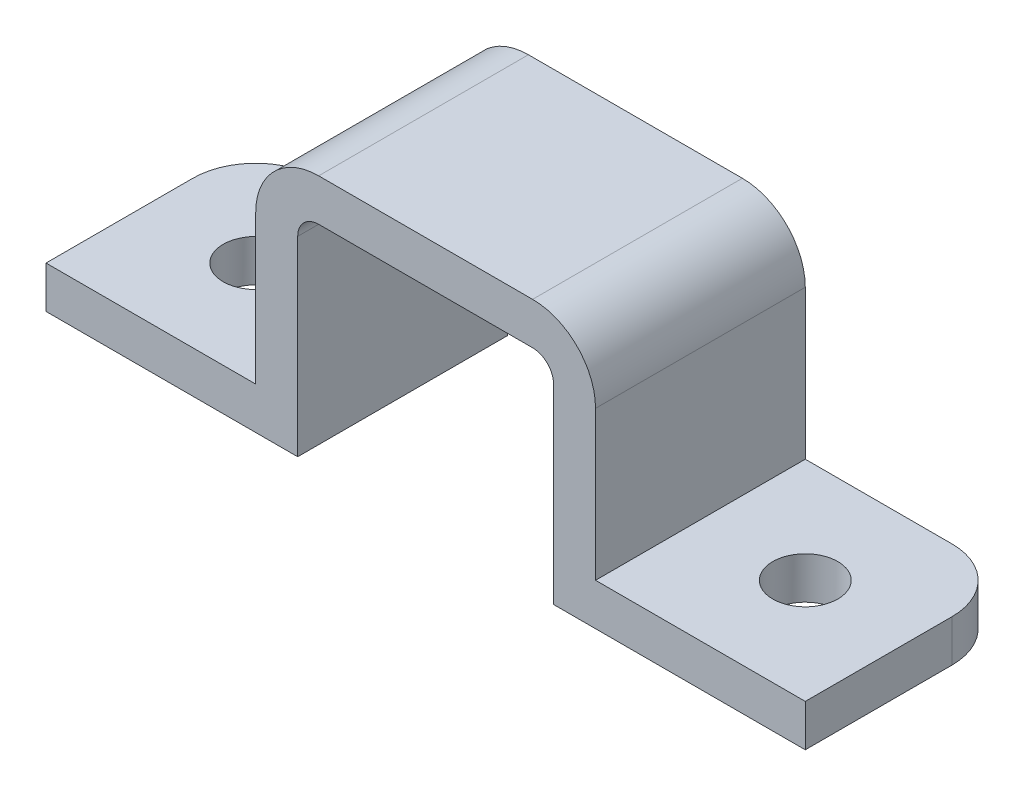
ISO-10303-21;
HEADER;
FILE_DESCRIPTION(('STEP AP214'),'2;1');
FILE_NAME('part.step','',(''),(''),'','','');
FILE_SCHEMA(('AUTOMOTIVE_DESIGN { 1 0 10303 214 1 1 1 1 }'));
ENDSEC;
DATA;
#1=APPLICATION_CONTEXT('core data for automotive mechanical design processes');
#2=APPLICATION_PROTOCOL_DEFINITION('international standard','automotive_design',2000,#1);
#3=PRODUCT_CONTEXT('',#1,'mechanical');
#4=PRODUCT('Part','Part','',(#3));
#5=PRODUCT_RELATED_PRODUCT_CATEGORY('part','',(#4));
#6=PRODUCT_DEFINITION_FORMATION('','',#4);
#7=PRODUCT_DEFINITION_CONTEXT('part definition',#1,'design');
#8=PRODUCT_DEFINITION('design','',#6,#7);
#9=PRODUCT_DEFINITION_SHAPE('','',#8);
#10=(LENGTH_UNIT() NAMED_UNIT(*) SI_UNIT(.MILLI.,.METRE.));
#11=(NAMED_UNIT(*) PLANE_ANGLE_UNIT() SI_UNIT($,.RADIAN.));
#12=(NAMED_UNIT(*) SI_UNIT($,.STERADIAN.) SOLID_ANGLE_UNIT());
#13=UNCERTAINTY_MEASURE_WITH_UNIT(LENGTH_MEASURE(1.E-05),#10,'distance_accuracy_value','');
#14=(GEOMETRIC_REPRESENTATION_CONTEXT(3) GLOBAL_UNCERTAINTY_ASSIGNED_CONTEXT((#13)) GLOBAL_UNIT_ASSIGNED_CONTEXT((#10,
#11,#12)) REPRESENTATION_CONTEXT('',''));
#15=CARTESIAN_POINT('',(0.,0.,0.));
#16=DIRECTION('',(0.,0.,1.));
#17=DIRECTION('',(1.,0.,0.));
#18=AXIS2_PLACEMENT_3D('',#15,#16,#17);
#19=CARTESIAN_POINT('',(-6.1,10.1,10.));
#20=DIRECTION('',(-1.,0.,0.));
#21=DIRECTION('',(0.,-1.,0.));
#22=AXIS2_PLACEMENT_3D('',#19,#20,#21);
#23=PLANE('',#22);
#24=DIRECTION('',(0.,1.,0.));
#25=VECTOR('',#24,1.);
#26=CARTESIAN_POINT('',(-6.1,10.1,0.));
#27=LINE('',#26,#25);
#28=CARTESIAN_POINT('',(-6.1,0.,0.));
#29=VERTEX_POINT('',#28);
#30=CARTESIAN_POINT('',(-6.1,9.1,0.));
#31=VERTEX_POINT('',#30);
#32=EDGE_CURVE('E206',#29,#31,#27,.T.);
#33=ORIENTED_EDGE('',*,*,#32,.T.);
#34=DIRECTION('',(0.,0.,-1.));
#35=VECTOR('',#34,1.);
#36=CARTESIAN_POINT('',(-6.1,9.1,10.));
#37=LINE('',#36,#35);
#38=CARTESIAN_POINT('',(-6.1,9.1,10.));
#39=VERTEX_POINT('',#38);
#40=EDGE_CURVE('E47',#31,#39,#37,.F.);
#41=ORIENTED_EDGE('',*,*,#40,.T.);
#42=DIRECTION('',(0.,1.,0.));
#43=VECTOR('',#42,1.);
#44=CARTESIAN_POINT('',(-6.1,10.1,10.));
#45=LINE('',#44,#43);
#46=CARTESIAN_POINT('',(-6.1,0.,10.));
#47=VERTEX_POINT('',#46);
#48=EDGE_CURVE('E230',#47,#39,#45,.T.);
#49=ORIENTED_EDGE('',*,*,#48,.F.);
#50=DIRECTION('',(0.,0.,-1.));
#51=VECTOR('',#50,1.);
#52=CARTESIAN_POINT('',(-6.1,0.,10.));
#53=LINE('',#52,#51);
#54=EDGE_CURVE('E205',#47,#29,#53,.T.);
#55=ORIENTED_EDGE('',*,*,#54,.T.);
#56=EDGE_LOOP('',(#33,#41,#49,#55));
#57=FACE_BOUND('',#56,.T.);
#58=ADVANCED_FACE('F32',(#57),#23,.F.);
#59=CARTESIAN_POINT('',(6.1,10.1,10.));
#60=DIRECTION('',(0.,1.,0.));
#61=DIRECTION('',(-1.,0.,0.));
#62=AXIS2_PLACEMENT_3D('',#59,#60,#61);
#63=PLANE('',#62);
#64=DIRECTION('',(1.,0.,0.));
#65=VECTOR('',#64,1.);
#66=CARTESIAN_POINT('',(6.1,10.1,0.));
#67=LINE('',#66,#65);
#68=CARTESIAN_POINT('',(-5.1,10.1,0.));
#69=VERTEX_POINT('',#68);
#70=CARTESIAN_POINT('',(5.1,10.1,0.));
#71=VERTEX_POINT('',#70);
#72=EDGE_CURVE('E208',#69,#71,#67,.T.);
#73=ORIENTED_EDGE('',*,*,#72,.T.);
#74=DIRECTION('',(0.,0.,-1.));
#75=VECTOR('',#74,1.);
#76=CARTESIAN_POINT('',(5.1,10.1,10.));
#77=LINE('',#76,#75);
#78=CARTESIAN_POINT('',(5.1,10.1,10.));
#79=VERTEX_POINT('',#78);
#80=EDGE_CURVE('E292',#71,#79,#77,.F.);
#81=ORIENTED_EDGE('',*,*,#80,.T.);
#82=DIRECTION('',(1.,0.,0.));
#83=VECTOR('',#82,1.);
#84=CARTESIAN_POINT('',(6.1,10.1,10.));
#85=LINE('',#84,#83);
#86=CARTESIAN_POINT('',(-5.1,10.1,10.));
#87=VERTEX_POINT('',#86);
#88=EDGE_CURVE('E169',#87,#79,#85,.T.);
#89=ORIENTED_EDGE('',*,*,#88,.F.);
#90=DIRECTION('',(0.,0.,-1.));
#91=VECTOR('',#90,1.);
#92=CARTESIAN_POINT('',(-5.1,10.1,0.));
#93=LINE('',#92,#91);
#94=EDGE_CURVE('E289',#87,#69,#93,.T.);
#95=ORIENTED_EDGE('',*,*,#94,.T.);
#96=EDGE_LOOP('',(#73,#81,#89,#95));
#97=FACE_BOUND('',#96,.T.);
#98=ADVANCED_FACE('F302',(#97),#63,.F.);
#99=CARTESIAN_POINT('',(6.1,10.1,10.));
#100=DIRECTION('',(1.,0.,0.));
#101=DIRECTION('',(0.,1.,0.));
#102=AXIS2_PLACEMENT_3D('',#99,#100,#101);
#103=PLANE('',#102);
#104=DIRECTION('',(0.,-1.,0.));
#105=VECTOR('',#104,1.);
#106=CARTESIAN_POINT('',(6.1,10.1,10.));
#107=LINE('',#106,#105);
#108=CARTESIAN_POINT('',(6.1,9.1,10.));
#109=VERTEX_POINT('',#108);
#110=CARTESIAN_POINT('',(6.1,0.,10.));
#111=VERTEX_POINT('',#110);
#112=EDGE_CURVE('E156',#109,#111,#107,.T.);
#113=ORIENTED_EDGE('',*,*,#112,.F.);
#114=DIRECTION('',(0.,0.,-1.));
#115=VECTOR('',#114,1.);
#116=CARTESIAN_POINT('',(6.1,9.1,0.));
#117=LINE('',#116,#115);
#118=CARTESIAN_POINT('',(6.1,9.1,0.));
#119=VERTEX_POINT('',#118);
#120=EDGE_CURVE('E287',#109,#119,#117,.T.);
#121=ORIENTED_EDGE('',*,*,#120,.T.);
#122=DIRECTION('',(0.,-1.,0.));
#123=VECTOR('',#122,1.);
#124=CARTESIAN_POINT('',(6.1,10.1,0.));
#125=LINE('',#124,#123);
#126=CARTESIAN_POINT('',(6.1,0.,0.));
#127=VERTEX_POINT('',#126);
#128=EDGE_CURVE('E175',#119,#127,#125,.T.);
#129=ORIENTED_EDGE('',*,*,#128,.T.);
#130=DIRECTION('',(0.,0.,-1.));
#131=VECTOR('',#130,1.);
#132=CARTESIAN_POINT('',(6.1,0.,10.));
#133=LINE('',#132,#131);
#134=EDGE_CURVE('E172',#111,#127,#133,.T.);
#135=ORIENTED_EDGE('',*,*,#134,.F.);
#136=EDGE_LOOP('',(#113,#121,#129,#135));
#137=FACE_BOUND('',#136,.T.);
#138=ADVANCED_FACE('F173',(#137),#103,.F.);
#139=CARTESIAN_POINT('',(6.1,0.,10.));
#140=DIRECTION('',(0.,1.,0.));
#141=DIRECTION('',(-1.,0.,0.));
#142=AXIS2_PLACEMENT_3D('',#139,#140,#141);
#143=PLANE('',#142);
#144=CARTESIAN_POINT('',(13.1,0.,5.));
#145=DIRECTION('',(0.,1.,0.));
#146=DIRECTION('',(-1.,0.,0.));
#147=AXIS2_PLACEMENT_3D('',#144,#145,#146);
#148=CIRCLE('',#147,1.55);
#149=CARTESIAN_POINT('',(11.55,0.,5.));
#150=VERTEX_POINT('',#149);
#151=EDGE_CURVE('E372',#150,#150,#148,.T.);
#152=ORIENTED_EDGE('',*,*,#151,.T.);
#153=EDGE_LOOP('',(#152));
#154=FACE_BOUND('',#153,.T.);
#155=DIRECTION('',(1.,0.,0.));
#156=VECTOR('',#155,1.);
#157=CARTESIAN_POINT('',(6.1,0.,0.));
#158=LINE('',#157,#156);
#159=CARTESIAN_POINT('',(15.1,0.,0.));
#160=VERTEX_POINT('',#159);
#161=EDGE_CURVE('E213',#127,#160,#158,.T.);
#162=ORIENTED_EDGE('',*,*,#161,.T.);
#163=CARTESIAN_POINT('',(15.1,0.,3.));
#164=DIRECTION('',(0.,1.,0.));
#165=DIRECTION('',(-1.,0.,0.));
#166=AXIS2_PLACEMENT_3D('',#163,#164,#165);
#167=CIRCLE('',#166,3.);
#168=CARTESIAN_POINT('',(18.1,0.,3.));
#169=VERTEX_POINT('',#168);
#170=EDGE_CURVE('E260',#160,#169,#167,.F.);
#171=ORIENTED_EDGE('',*,*,#170,.T.);
#172=DIRECTION('',(0.,0.,-1.));
#173=VECTOR('',#172,1.);
#174=CARTESIAN_POINT('',(18.1,0.,10.));
#175=LINE('',#174,#173);
#176=CARTESIAN_POINT('',(18.1,0.,10.));
#177=VERTEX_POINT('',#176);
#178=EDGE_CURVE('E180',#177,#169,#175,.T.);
#179=ORIENTED_EDGE('',*,*,#178,.F.);
#180=DIRECTION('',(1.,0.,0.));
#181=VECTOR('',#180,1.);
#182=CARTESIAN_POINT('',(6.1,0.,10.));
#183=LINE('',#182,#181);
#184=EDGE_CURVE('E161',#111,#177,#183,.T.);
#185=ORIENTED_EDGE('',*,*,#184,.F.);
#186=ORIENTED_EDGE('',*,*,#134,.T.);
#187=EDGE_LOOP('',(#162,#171,#179,#185,#186));
#188=FACE_BOUND('',#187,.T.);
#189=ADVANCED_FACE('F182',(#154,#188),#143,.F.);
#190=CARTESIAN_POINT('',(18.1,0.,10.));
#191=DIRECTION('',(-1.,0.,0.));
#192=DIRECTION('',(0.,0.,1.));
#193=AXIS2_PLACEMENT_3D('',#190,#191,#192);
#194=PLANE('',#193);
#195=ORIENTED_EDGE('',*,*,#178,.T.);
#196=DIRECTION('',(0.,1.,0.));
#197=VECTOR('',#196,1.);
#198=CARTESIAN_POINT('',(18.1,2.,3.));
#199=LINE('',#198,#197);
#200=CARTESIAN_POINT('',(18.1,2.,3.));
#201=VERTEX_POINT('',#200);
#202=EDGE_CURVE('E179',#169,#201,#199,.T.);
#203=ORIENTED_EDGE('',*,*,#202,.T.);
#204=DIRECTION('',(0.,0.,-1.));
#205=VECTOR('',#204,1.);
#206=CARTESIAN_POINT('',(18.1,2.,10.));
#207=LINE('',#206,#205);
#208=CARTESIAN_POINT('',(18.1,2.,10.));
#209=VERTEX_POINT('',#208);
#210=EDGE_CURVE('E245',#209,#201,#207,.T.);
#211=ORIENTED_EDGE('',*,*,#210,.F.);
#212=DIRECTION('',(0.,1.,0.));
#213=VECTOR('',#212,1.);
#214=CARTESIAN_POINT('',(18.1,0.,10.));
#215=LINE('',#214,#213);
#216=EDGE_CURVE('E185',#177,#209,#215,.T.);
#217=ORIENTED_EDGE('',*,*,#216,.F.);
#218=EDGE_LOOP('',(#195,#203,#211,#217));
#219=FACE_BOUND('',#218,.T.);
#220=ADVANCED_FACE('F385',(#219),#194,.F.);
#221=CARTESIAN_POINT('',(18.1,2.,10.));
#222=DIRECTION('',(0.,-1.,0.));
#223=DIRECTION('',(1.,0.,0.));
#224=AXIS2_PLACEMENT_3D('',#221,#222,#223);
#225=PLANE('',#224);
#226=CARTESIAN_POINT('',(13.1,2.,5.));
#227=DIRECTION('',(0.,1.,0.));
#228=DIRECTION('',(0.,0.,1.));
#229=AXIS2_PLACEMENT_3D('',#226,#227,#228);
#230=CIRCLE('',#229,1.55);
#231=CARTESIAN_POINT('',(13.1,2.,6.55));
#232=VERTEX_POINT('',#231);
#233=EDGE_CURVE('E375',#232,#232,#230,.T.);
#234=ORIENTED_EDGE('',*,*,#233,.F.);
#235=EDGE_LOOP('',(#234));
#236=FACE_BOUND('',#235,.T.);
#237=ORIENTED_EDGE('',*,*,#210,.T.);
#238=CARTESIAN_POINT('',(15.1,2.,3.));
#239=DIRECTION('',(0.,-1.,0.));
#240=DIRECTION('',(1.,0.,0.));
#241=AXIS2_PLACEMENT_3D('',#238,#239,#240);
#242=CIRCLE('',#241,3.);
#243=CARTESIAN_POINT('',(15.1,2.,0.));
#244=VERTEX_POINT('',#243);
#245=EDGE_CURVE('E254',#201,#244,#242,.F.);
#246=ORIENTED_EDGE('',*,*,#245,.T.);
#247=DIRECTION('',(-1.,0.,0.));
#248=VECTOR('',#247,1.);
#249=CARTESIAN_POINT('',(18.1,2.,0.));
#250=LINE('',#249,#248);
#251=CARTESIAN_POINT('',(8.1,2.,0.));
#252=VERTEX_POINT('',#251);
#253=EDGE_CURVE('E215',#244,#252,#250,.T.);
#254=ORIENTED_EDGE('',*,*,#253,.T.);
#255=DIRECTION('',(0.,0.,-1.));
#256=VECTOR('',#255,1.);
#257=CARTESIAN_POINT('',(8.1,2.,10.));
#258=LINE('',#257,#256);
#259=CARTESIAN_POINT('',(8.1,2.,10.));
#260=VERTEX_POINT('',#259);
#261=EDGE_CURVE('E242',#260,#252,#258,.T.);
#262=ORIENTED_EDGE('',*,*,#261,.F.);
#263=DIRECTION('',(-1.,0.,0.));
#264=VECTOR('',#263,1.);
#265=CARTESIAN_POINT('',(18.1,2.,10.));
#266=LINE('',#265,#264);
#267=EDGE_CURVE('E187',#209,#260,#266,.T.);
#268=ORIENTED_EDGE('',*,*,#267,.F.);
#269=EDGE_LOOP('',(#237,#246,#254,#262,#268));
#270=FACE_BOUND('',#269,.T.);
#271=ADVANCED_FACE('F381',(#236,#270),#225,.F.);
#272=CARTESIAN_POINT('',(8.1,2.,10.));
#273=DIRECTION('',(-1.,0.,0.));
#274=DIRECTION('',(0.,-1.,0.));
#275=AXIS2_PLACEMENT_3D('',#272,#273,#274);
#276=PLANE('',#275);
#277=DIRECTION('',(0.,1.,0.));
#278=VECTOR('',#277,1.);
#279=CARTESIAN_POINT('',(8.1,2.,0.));
#280=LINE('',#279,#278);
#281=CARTESIAN_POINT('',(8.1,9.1,0.));
#282=VERTEX_POINT('',#281);
#283=EDGE_CURVE('E217',#252,#282,#280,.T.);
#284=ORIENTED_EDGE('',*,*,#283,.T.);
#285=DIRECTION('',(0.,0.,-1.));
#286=VECTOR('',#285,1.);
#287=CARTESIAN_POINT('',(8.1,9.1,10.));
#288=LINE('',#287,#286);
#289=CARTESIAN_POINT('',(8.1,9.1,10.));
#290=VERTEX_POINT('',#289);
#291=EDGE_CURVE('E278',#282,#290,#288,.F.);
#292=ORIENTED_EDGE('',*,*,#291,.T.);
#293=DIRECTION('',(0.,1.,0.));
#294=VECTOR('',#293,1.);
#295=CARTESIAN_POINT('',(8.1,2.,10.));
#296=LINE('',#295,#294);
#297=EDGE_CURVE('E192',#260,#290,#296,.T.);
#298=ORIENTED_EDGE('',*,*,#297,.F.);
#299=ORIENTED_EDGE('',*,*,#261,.T.);
#300=EDGE_LOOP('',(#284,#292,#298,#299));
#301=FACE_BOUND('',#300,.T.);
#302=ADVANCED_FACE('F384',(#301),#276,.F.);
#303=CARTESIAN_POINT('',(-8.1,12.1,10.));
#304=DIRECTION('',(0.,-1.,0.));
#305=DIRECTION('',(1.,0.,0.));
#306=AXIS2_PLACEMENT_3D('',#303,#304,#305);
#307=PLANE('',#306);
#308=DIRECTION('',(-1.,0.,0.));
#309=VECTOR('',#308,1.);
#310=CARTESIAN_POINT('',(-8.1,12.1,10.));
#311=LINE('',#310,#309);
#312=CARTESIAN_POINT('',(5.1,12.1,10.));
#313=VERTEX_POINT('',#312);
#314=CARTESIAN_POINT('',(-5.1,12.1,10.));
#315=VERTEX_POINT('',#314);
#316=EDGE_CURVE('E194',#313,#315,#311,.T.);
#317=ORIENTED_EDGE('',*,*,#316,.F.);
#318=DIRECTION('',(0.,0.,-1.));
#319=VECTOR('',#318,1.);
#320=CARTESIAN_POINT('',(5.1,12.1,10.));
#321=LINE('',#320,#319);
#322=CARTESIAN_POINT('',(5.1,12.1,0.));
#323=VERTEX_POINT('',#322);
#324=EDGE_CURVE('E271',#313,#323,#321,.T.);
#325=ORIENTED_EDGE('',*,*,#324,.T.);
#326=DIRECTION('',(-1.,0.,0.));
#327=VECTOR('',#326,1.);
#328=CARTESIAN_POINT('',(-8.1,12.1,0.));
#329=LINE('',#328,#327);
#330=CARTESIAN_POINT('',(-5.1,12.1,0.));
#331=VERTEX_POINT('',#330);
#332=EDGE_CURVE('E220',#323,#331,#329,.T.);
#333=ORIENTED_EDGE('',*,*,#332,.T.);
#334=DIRECTION('',(0.,0.,-1.));
#335=VECTOR('',#334,1.);
#336=CARTESIAN_POINT('',(-5.1,12.1,10.));
#337=LINE('',#336,#335);
#338=EDGE_CURVE('E269',#331,#315,#337,.F.);
#339=ORIENTED_EDGE('',*,*,#338,.T.);
#340=EDGE_LOOP('',(#317,#325,#333,#339));
#341=FACE_BOUND('',#340,.T.);
#342=ADVANCED_FACE('F344',(#341),#307,.F.);
#343=CARTESIAN_POINT('',(-8.1,2.,10.));
#344=DIRECTION('',(1.,0.,0.));
#345=DIRECTION('',(0.,0.,-1.));
#346=AXIS2_PLACEMENT_3D('',#343,#344,#345);
#347=PLANE('',#346);
#348=DIRECTION('',(0.,-1.,0.));
#349=VECTOR('',#348,1.);
#350=CARTESIAN_POINT('',(-8.1,2.,10.));
#351=LINE('',#350,#349);
#352=CARTESIAN_POINT('',(-8.1,9.1,10.));
#353=VERTEX_POINT('',#352);
#354=CARTESIAN_POINT('',(-8.1,2.,10.));
#355=VERTEX_POINT('',#354);
#356=EDGE_CURVE('E197',#353,#355,#351,.T.);
#357=ORIENTED_EDGE('',*,*,#356,.F.);
#358=DIRECTION('',(0.,0.,-1.));
#359=VECTOR('',#358,1.);
#360=CARTESIAN_POINT('',(-8.1,9.1,10.));
#361=LINE('',#360,#359);
#362=CARTESIAN_POINT('',(-8.1,9.1,0.));
#363=VERTEX_POINT('',#362);
#364=EDGE_CURVE('E284',#353,#363,#361,.T.);
#365=ORIENTED_EDGE('',*,*,#364,.T.);
#366=DIRECTION('',(0.,-1.,0.));
#367=VECTOR('',#366,1.);
#368=CARTESIAN_POINT('',(-8.1,2.,0.));
#369=LINE('',#368,#367);
#370=CARTESIAN_POINT('',(-8.1,2.,0.));
#371=VERTEX_POINT('',#370);
#372=EDGE_CURVE('E223',#363,#371,#369,.T.);
#373=ORIENTED_EDGE('',*,*,#372,.T.);
#374=DIRECTION('',(0.,0.,-1.));
#375=VECTOR('',#374,1.);
#376=CARTESIAN_POINT('',(-8.1,2.,10.));
#377=LINE('',#376,#375);
#378=EDGE_CURVE('E239',#355,#371,#377,.T.);
#379=ORIENTED_EDGE('',*,*,#378,.F.);
#380=EDGE_LOOP('',(#357,#365,#373,#379));
#381=FACE_BOUND('',#380,.T.);
#382=ADVANCED_FACE('F350',(#381),#347,.F.);
#383=CARTESIAN_POINT('',(-18.1,2.,10.));
#384=DIRECTION('',(0.,-1.,0.));
#385=DIRECTION('',(0.,0.,-1.));
#386=AXIS2_PLACEMENT_3D('',#383,#384,#385);
#387=PLANE('',#386);
#388=CARTESIAN_POINT('',(-13.1,2.,5.));
#389=DIRECTION('',(0.,1.,0.));
#390=DIRECTION('',(0.,0.,1.));
#391=AXIS2_PLACEMENT_3D('',#388,#389,#390);
#392=CIRCLE('',#391,1.55);
#393=CARTESIAN_POINT('',(-13.1,2.,6.55));
#394=VERTEX_POINT('',#393);
#395=EDGE_CURVE('E251',#394,#394,#392,.T.);
#396=ORIENTED_EDGE('',*,*,#395,.F.);
#397=EDGE_LOOP('',(#396));
#398=FACE_BOUND('',#397,.T.);
#399=DIRECTION('',(-1.,0.,0.));
#400=VECTOR('',#399,1.);
#401=CARTESIAN_POINT('',(-18.1,2.,0.));
#402=LINE('',#401,#400);
#403=CARTESIAN_POINT('',(-15.1,2.,0.));
#404=VERTEX_POINT('',#403);
#405=EDGE_CURVE('E225',#371,#404,#402,.T.);
#406=ORIENTED_EDGE('',*,*,#405,.T.);
#407=CARTESIAN_POINT('',(-15.1,2.,3.));
#408=DIRECTION('',(0.,-1.,0.));
#409=DIRECTION('',(0.,0.,-1.));
#410=AXIS2_PLACEMENT_3D('',#407,#408,#409);
#411=CIRCLE('',#410,3.);
#412=CARTESIAN_POINT('',(-18.1,2.,3.));
#413=VERTEX_POINT('',#412);
#414=EDGE_CURVE('E267',#404,#413,#411,.F.);
#415=ORIENTED_EDGE('',*,*,#414,.T.);
#416=DIRECTION('',(0.,0.,-1.));
#417=VECTOR('',#416,1.);
#418=CARTESIAN_POINT('',(-18.1,2.,10.));
#419=LINE('',#418,#417);
#420=CARTESIAN_POINT('',(-18.1,2.,10.));
#421=VERTEX_POINT('',#420);
#422=EDGE_CURVE('E236',#421,#413,#419,.T.);
#423=ORIENTED_EDGE('',*,*,#422,.F.);
#424=DIRECTION('',(-1.,0.,0.));
#425=VECTOR('',#424,1.);
#426=CARTESIAN_POINT('',(-18.1,2.,10.));
#427=LINE('',#426,#425);
#428=EDGE_CURVE('E199',#355,#421,#427,.T.);
#429=ORIENTED_EDGE('',*,*,#428,.F.);
#430=ORIENTED_EDGE('',*,*,#378,.T.);
#431=EDGE_LOOP('',(#406,#415,#423,#429,#430));
#432=FACE_BOUND('',#431,.T.);
#433=ADVANCED_FACE('F356',(#398,#432),#387,.F.);
#434=CARTESIAN_POINT('',(-18.1,0.,10.));
#435=DIRECTION('',(1.,0.,0.));
#436=DIRECTION('',(0.,0.,-1.));
#437=AXIS2_PLACEMENT_3D('',#434,#435,#436);
#438=PLANE('',#437);
#439=ORIENTED_EDGE('',*,*,#422,.T.);
#440=DIRECTION('',(0.,-1.,0.));
#441=VECTOR('',#440,1.);
#442=CARTESIAN_POINT('',(-18.1,0.,3.));
#443=LINE('',#442,#441);
#444=CARTESIAN_POINT('',(-18.1,0.,3.));
#445=VERTEX_POINT('',#444);
#446=EDGE_CURVE('E262',#413,#445,#443,.T.);
#447=ORIENTED_EDGE('',*,*,#446,.T.);
#448=DIRECTION('',(0.,0.,-1.));
#449=VECTOR('',#448,1.);
#450=CARTESIAN_POINT('',(-18.1,0.,10.));
#451=LINE('',#450,#449);
#452=CARTESIAN_POINT('',(-18.1,0.,10.));
#453=VERTEX_POINT('',#452);
#454=EDGE_CURVE('E233',#453,#445,#451,.T.);
#455=ORIENTED_EDGE('',*,*,#454,.F.);
#456=DIRECTION('',(0.,-1.,0.));
#457=VECTOR('',#456,1.);
#458=CARTESIAN_POINT('',(-18.1,0.,10.));
#459=LINE('',#458,#457);
#460=EDGE_CURVE('E201',#421,#453,#459,.T.);
#461=ORIENTED_EDGE('',*,*,#460,.F.);
#462=EDGE_LOOP('',(#439,#447,#455,#461));
#463=FACE_BOUND('',#462,.T.);
#464=ADVANCED_FACE('F362',(#463),#438,.F.);
#465=CARTESIAN_POINT('',(-6.1,0.,10.));
#466=DIRECTION('',(0.,1.,0.));
#467=DIRECTION('',(-1.,0.,0.));
#468=AXIS2_PLACEMENT_3D('',#465,#466,#467);
#469=PLANE('',#468);
#470=CARTESIAN_POINT('',(-13.1,0.,5.));
#471=DIRECTION('',(0.,1.,0.));
#472=DIRECTION('',(-1.,0.,0.));
#473=AXIS2_PLACEMENT_3D('',#470,#471,#472);
#474=CIRCLE('',#473,1.55);
#475=CARTESIAN_POINT('',(-14.65,0.,5.));
#476=VERTEX_POINT('',#475);
#477=EDGE_CURVE('E209',#476,#476,#474,.T.);
#478=ORIENTED_EDGE('',*,*,#477,.T.);
#479=EDGE_LOOP('',(#478));
#480=FACE_BOUND('',#479,.T.);
#481=ORIENTED_EDGE('',*,*,#454,.T.);
#482=CARTESIAN_POINT('',(-15.1,0.,3.));
#483=DIRECTION('',(0.,1.,0.));
#484=DIRECTION('',(-1.,0.,0.));
#485=AXIS2_PLACEMENT_3D('',#482,#483,#484);
#486=CIRCLE('',#485,3.);
#487=CARTESIAN_POINT('',(-15.1,0.,0.));
#488=VERTEX_POINT('',#487);
#489=EDGE_CURVE('E265',#445,#488,#486,.F.);
#490=ORIENTED_EDGE('',*,*,#489,.T.);
#491=DIRECTION('',(1.,0.,0.));
#492=VECTOR('',#491,1.);
#493=CARTESIAN_POINT('',(-6.1,0.,0.));
#494=LINE('',#493,#492);
#495=EDGE_CURVE('E228',#488,#29,#494,.T.);
#496=ORIENTED_EDGE('',*,*,#495,.T.);
#497=ORIENTED_EDGE('',*,*,#54,.F.);
#498=DIRECTION('',(1.,0.,0.));
#499=VECTOR('',#498,1.);
#500=CARTESIAN_POINT('',(-6.1,0.,10.));
#501=LINE('',#500,#499);
#502=EDGE_CURVE('E203',#453,#47,#501,.T.);
#503=ORIENTED_EDGE('',*,*,#502,.F.);
#504=EDGE_LOOP('',(#481,#490,#496,#497,#503));
#505=FACE_BOUND('',#504,.T.);
#506=ADVANCED_FACE('F365',(#480,#505),#469,.F.);
#507=CARTESIAN_POINT('',(0.,0.,10.));
#508=DIRECTION('',(0.,0.,-1.));
#509=DIRECTION('',(-1.,0.,0.));
#510=AXIS2_PLACEMENT_3D('',#507,#508,#509);
#511=PLANE('',#510);
#512=ORIENTED_EDGE('',*,*,#297,.T.);
#513=CARTESIAN_POINT('',(5.1,9.1,10.));
#514=DIRECTION('',(0.,0.,-1.));
#515=DIRECTION('',(-1.,0.,0.));
#516=AXIS2_PLACEMENT_3D('',#513,#514,#515);
#517=CIRCLE('',#516,3.);
#518=EDGE_CURVE('E282',#290,#313,#517,.F.);
#519=ORIENTED_EDGE('',*,*,#518,.T.);
#520=ORIENTED_EDGE('',*,*,#316,.T.);
#521=CARTESIAN_POINT('',(-5.1,9.1,10.));
#522=DIRECTION('',(0.,0.,-1.));
#523=DIRECTION('',(-1.,0.,0.));
#524=AXIS2_PLACEMENT_3D('',#521,#522,#523);
#525=CIRCLE('',#524,3.);
#526=EDGE_CURVE('E280',#315,#353,#525,.F.);
#527=ORIENTED_EDGE('',*,*,#526,.T.);
#528=ORIENTED_EDGE('',*,*,#356,.T.);
#529=ORIENTED_EDGE('',*,*,#428,.T.);
#530=ORIENTED_EDGE('',*,*,#460,.T.);
#531=ORIENTED_EDGE('',*,*,#502,.T.);
#532=ORIENTED_EDGE('',*,*,#48,.T.);
#533=CARTESIAN_POINT('',(-5.1,9.1,10.));
#534=DIRECTION('',(0.,0.,-1.));
#535=DIRECTION('',(-1.,0.,0.));
#536=AXIS2_PLACEMENT_3D('',#533,#534,#535);
#537=CIRCLE('',#536,1.);
#538=EDGE_CURVE('E11',#39,#87,#537,.T.);
#539=ORIENTED_EDGE('',*,*,#538,.T.);
#540=ORIENTED_EDGE('',*,*,#88,.T.);
#541=CARTESIAN_POINT('',(5.1,9.1,10.));
#542=DIRECTION('',(0.,0.,-1.));
#543=DIRECTION('',(-1.,0.,0.));
#544=AXIS2_PLACEMENT_3D('',#541,#542,#543);
#545=CIRCLE('',#544,1.);
#546=EDGE_CURVE('E165',#79,#109,#545,.T.);
#547=ORIENTED_EDGE('',*,*,#546,.T.);
#548=ORIENTED_EDGE('',*,*,#112,.T.);
#549=ORIENTED_EDGE('',*,*,#184,.T.);
#550=ORIENTED_EDGE('',*,*,#216,.T.);
#551=ORIENTED_EDGE('',*,*,#267,.T.);
#552=EDGE_LOOP('',(#512,#519,#520,#527,#528,#529,#530,#531,#532,#539,#540,#547,#548,#549,#550,#551));
#553=FACE_BOUND('',#552,.T.);
#554=ADVANCED_FACE('F159',(#553),#511,.F.);
#555=CARTESIAN_POINT('',(0.,0.,0.));
#556=DIRECTION('',(0.,0.,-1.));
#557=DIRECTION('',(-1.,0.,0.));
#558=AXIS2_PLACEMENT_3D('',#555,#556,#557);
#559=PLANE('',#558);
#560=ORIENTED_EDGE('',*,*,#332,.F.);
#561=CARTESIAN_POINT('',(5.1,9.1,0.));
#562=DIRECTION('',(0.,0.,-1.));
#563=DIRECTION('',(-1.,0.,0.));
#564=AXIS2_PLACEMENT_3D('',#561,#562,#563);
#565=CIRCLE('',#564,3.);
#566=EDGE_CURVE('E276',#323,#282,#565,.T.);
#567=ORIENTED_EDGE('',*,*,#566,.T.);
#568=ORIENTED_EDGE('',*,*,#283,.F.);
#569=ORIENTED_EDGE('',*,*,#253,.F.);
#570=DIRECTION('',(0.,1.,0.));
#571=VECTOR('',#570,1.);
#572=CARTESIAN_POINT('',(15.1,0.,0.));
#573=LINE('',#572,#571);
#574=EDGE_CURVE('E258',#244,#160,#573,.F.);
#575=ORIENTED_EDGE('',*,*,#574,.T.);
#576=ORIENTED_EDGE('',*,*,#161,.F.);
#577=ORIENTED_EDGE('',*,*,#128,.F.);
#578=CARTESIAN_POINT('',(5.1,9.1,0.));
#579=DIRECTION('',(0.,0.,-1.));
#580=DIRECTION('',(-1.,0.,0.));
#581=AXIS2_PLACEMENT_3D('',#578,#579,#580);
#582=CIRCLE('',#581,1.);
#583=EDGE_CURVE('E295',#119,#71,#582,.F.);
#584=ORIENTED_EDGE('',*,*,#583,.T.);
#585=ORIENTED_EDGE('',*,*,#72,.F.);
#586=CARTESIAN_POINT('',(-5.1,9.1,0.));
#587=DIRECTION('',(0.,0.,-1.));
#588=DIRECTION('',(-1.,0.,0.));
#589=AXIS2_PLACEMENT_3D('',#586,#587,#588);
#590=CIRCLE('',#589,1.);
#591=EDGE_CURVE('E40',#69,#31,#590,.F.);
#592=ORIENTED_EDGE('',*,*,#591,.T.);
#593=ORIENTED_EDGE('',*,*,#32,.F.);
#594=ORIENTED_EDGE('',*,*,#495,.F.);
#595=DIRECTION('',(0.,-1.,0.));
#596=VECTOR('',#595,1.);
#597=CARTESIAN_POINT('',(-15.1,2.,0.));
#598=LINE('',#597,#596);
#599=EDGE_CURVE('E256',#488,#404,#598,.F.);
#600=ORIENTED_EDGE('',*,*,#599,.T.);
#601=ORIENTED_EDGE('',*,*,#405,.F.);
#602=ORIENTED_EDGE('',*,*,#372,.F.);
#603=CARTESIAN_POINT('',(-5.1,9.1,0.));
#604=DIRECTION('',(0.,0.,-1.));
#605=DIRECTION('',(-1.,0.,0.));
#606=AXIS2_PLACEMENT_3D('',#603,#604,#605);
#607=CIRCLE('',#606,3.);
#608=EDGE_CURVE('E274',#363,#331,#607,.T.);
#609=ORIENTED_EDGE('',*,*,#608,.T.);
#610=EDGE_LOOP('',(#560,#567,#568,#569,#575,#576,#577,#584,#585,#592,#593,#594,#600,#601,#602,#609));
#611=FACE_BOUND('',#610,.T.);
#612=ADVANCED_FACE('F298',(#611),#559,.T.);
#613=CARTESIAN_POINT('',(-13.1,-8.,5.));
#614=DIRECTION('',(0.,1.,0.));
#615=DIRECTION('',(0.,0.,1.));
#616=AXIS2_PLACEMENT_3D('',#613,#614,#615);
#617=CYLINDRICAL_SURFACE('',#616,1.55);
#618=ORIENTED_EDGE('',*,*,#395,.T.);
#619=EDGE_LOOP('',(#618));
#620=FACE_BOUND('',#619,.T.);
#621=ORIENTED_EDGE('',*,*,#477,.F.);
#622=EDGE_LOOP('',(#621));
#623=FACE_BOUND('',#622,.T.);
#624=ADVANCED_FACE('F529',(#620,#623),#617,.F.);
#625=CARTESIAN_POINT('',(13.1,-8.,5.));
#626=DIRECTION('',(0.,1.,0.));
#627=DIRECTION('',(0.,0.,1.));
#628=AXIS2_PLACEMENT_3D('',#625,#626,#627);
#629=CYLINDRICAL_SURFACE('',#628,1.55);
#630=ORIENTED_EDGE('',*,*,#233,.T.);
#631=EDGE_LOOP('',(#630));
#632=FACE_BOUND('',#631,.T.);
#633=ORIENTED_EDGE('',*,*,#151,.F.);
#634=EDGE_LOOP('',(#633));
#635=FACE_BOUND('',#634,.T.);
#636=ADVANCED_FACE('F328',(#632,#635),#629,.F.);
#637=CARTESIAN_POINT('',(15.1,0.,3.));
#638=DIRECTION('',(0.,-1.,0.));
#639=DIRECTION('',(0.,0.,-1.));
#640=AXIS2_PLACEMENT_3D('',#637,#638,#639);
#641=CYLINDRICAL_SURFACE('',#640,3.);
#642=ORIENTED_EDGE('',*,*,#170,.F.);
#643=ORIENTED_EDGE('',*,*,#574,.F.);
#644=ORIENTED_EDGE('',*,*,#245,.F.);
#645=ORIENTED_EDGE('',*,*,#202,.F.);
#646=EDGE_LOOP('',(#642,#643,#644,#645));
#647=FACE_BOUND('',#646,.T.);
#648=ADVANCED_FACE('F324',(#647),#641,.T.);
#649=CARTESIAN_POINT('',(-15.1,0.,3.));
#650=DIRECTION('',(0.,1.,0.));
#651=DIRECTION('',(0.,0.,1.));
#652=AXIS2_PLACEMENT_3D('',#649,#650,#651);
#653=CYLINDRICAL_SURFACE('',#652,3.);
#654=ORIENTED_EDGE('',*,*,#414,.F.);
#655=ORIENTED_EDGE('',*,*,#599,.F.);
#656=ORIENTED_EDGE('',*,*,#489,.F.);
#657=ORIENTED_EDGE('',*,*,#446,.F.);
#658=EDGE_LOOP('',(#654,#655,#656,#657));
#659=FACE_BOUND('',#658,.T.);
#660=ADVANCED_FACE('F327',(#659),#653,.T.);
#661=CARTESIAN_POINT('',(5.1,9.1,10.));
#662=DIRECTION('',(0.,0.,-1.));
#663=DIRECTION('',(-1.,0.,0.));
#664=AXIS2_PLACEMENT_3D('',#661,#662,#663);
#665=CYLINDRICAL_SURFACE('',#664,3.);
#666=ORIENTED_EDGE('',*,*,#518,.F.);
#667=ORIENTED_EDGE('',*,*,#291,.F.);
#668=ORIENTED_EDGE('',*,*,#566,.F.);
#669=ORIENTED_EDGE('',*,*,#324,.F.);
#670=EDGE_LOOP('',(#666,#667,#668,#669));
#671=FACE_BOUND('',#670,.T.);
#672=ADVANCED_FACE('F313',(#671),#665,.T.);
#673=CARTESIAN_POINT('',(-5.1,9.1,10.));
#674=DIRECTION('',(0.,0.,-1.));
#675=DIRECTION('',(-1.,0.,0.));
#676=AXIS2_PLACEMENT_3D('',#673,#674,#675);
#677=CYLINDRICAL_SURFACE('',#676,3.);
#678=ORIENTED_EDGE('',*,*,#526,.F.);
#679=ORIENTED_EDGE('',*,*,#338,.F.);
#680=ORIENTED_EDGE('',*,*,#608,.F.);
#681=ORIENTED_EDGE('',*,*,#364,.F.);
#682=EDGE_LOOP('',(#678,#679,#680,#681));
#683=FACE_BOUND('',#682,.T.);
#684=ADVANCED_FACE('F307',(#683),#677,.T.);
#685=CARTESIAN_POINT('',(5.1,9.1,10.));
#686=DIRECTION('',(0.,0.,1.));
#687=DIRECTION('',(1.,0.,0.));
#688=AXIS2_PLACEMENT_3D('',#685,#686,#687);
#689=CYLINDRICAL_SURFACE('',#688,1.);
#690=ORIENTED_EDGE('',*,*,#546,.F.);
#691=ORIENTED_EDGE('',*,*,#80,.F.);
#692=ORIENTED_EDGE('',*,*,#583,.F.);
#693=ORIENTED_EDGE('',*,*,#120,.F.);
#694=EDGE_LOOP('',(#690,#691,#692,#693));
#695=FACE_BOUND('',#694,.T.);
#696=ADVANCED_FACE('F305',(#695),#689,.F.);
#697=CARTESIAN_POINT('',(-5.1,9.1,10.));
#698=DIRECTION('',(0.,0.,1.));
#699=DIRECTION('',(1.,0.,0.));
#700=AXIS2_PLACEMENT_3D('',#697,#698,#699);
#701=CYLINDRICAL_SURFACE('',#700,1.);
#702=ORIENTED_EDGE('',*,*,#538,.F.);
#703=ORIENTED_EDGE('',*,*,#40,.F.);
#704=ORIENTED_EDGE('',*,*,#591,.F.);
#705=ORIENTED_EDGE('',*,*,#94,.F.);
#706=EDGE_LOOP('',(#702,#703,#704,#705));
#707=FACE_BOUND('',#706,.T.);
#708=ADVANCED_FACE('F34',(#707),#701,.F.);
#709=CLOSED_SHELL('',(#58,#98,#138,#189,#220,#271,#302,#342,#382,#433,#464,#506,#554,#612,#624,
#636,#648,#660,#672,#684,#696,#708));
#710=MANIFOLD_SOLID_BREP('B2',#709);
#711=ADVANCED_BREP_SHAPE_REPRESENTATION('',(#18,#710),#14);
#712=SHAPE_DEFINITION_REPRESENTATION(#9,#711);
ENDSEC;
END-ISO-10303-21;
